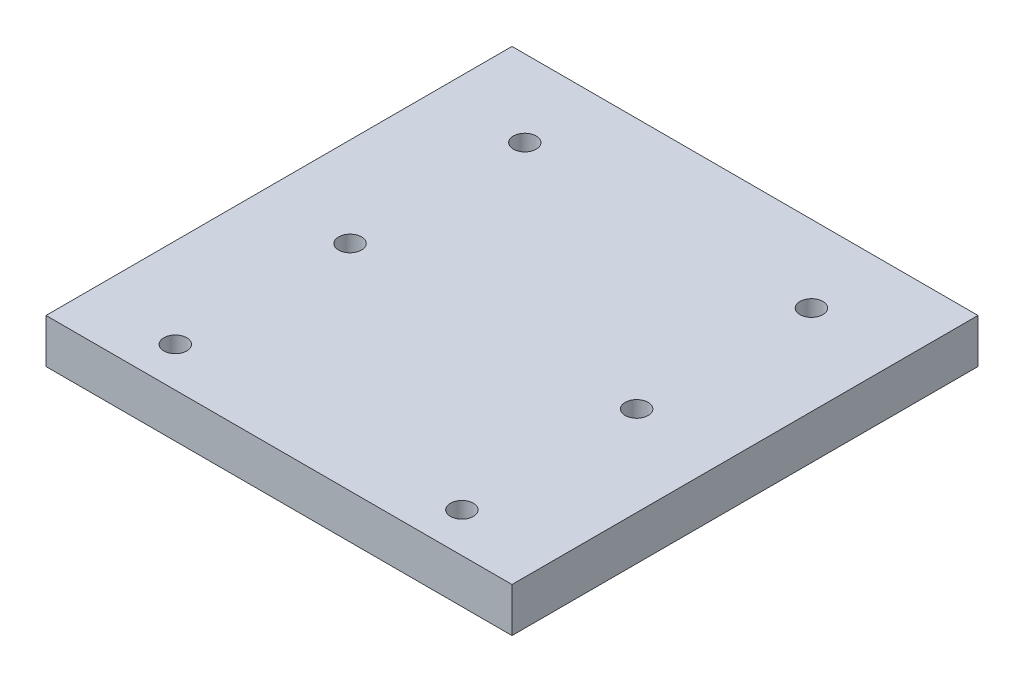
ISO-10303-21;
HEADER;
FILE_DESCRIPTION(('STEP AP214'),'2;1');
FILE_NAME('part.step','',(''),(''),'','','');
FILE_SCHEMA(('AUTOMOTIVE_DESIGN { 1 0 10303 214 1 1 1 1 }'));
ENDSEC;
DATA;
#1=APPLICATION_CONTEXT('core data for automotive mechanical design processes');
#2=APPLICATION_PROTOCOL_DEFINITION('international standard','automotive_design',2000,#1);
#3=PRODUCT_CONTEXT('',#1,'mechanical');
#4=PRODUCT('Part','Part','',(#3));
#5=PRODUCT_RELATED_PRODUCT_CATEGORY('part','',(#4));
#6=PRODUCT_DEFINITION_FORMATION('','',#4);
#7=PRODUCT_DEFINITION_CONTEXT('part definition',#1,'design');
#8=PRODUCT_DEFINITION('design','',#6,#7);
#9=PRODUCT_DEFINITION_SHAPE('','',#8);
#10=(LENGTH_UNIT() NAMED_UNIT(*) SI_UNIT(.MILLI.,.METRE.));
#11=(NAMED_UNIT(*) PLANE_ANGLE_UNIT() SI_UNIT($,.RADIAN.));
#12=(NAMED_UNIT(*) SI_UNIT($,.STERADIAN.) SOLID_ANGLE_UNIT());
#13=UNCERTAINTY_MEASURE_WITH_UNIT(LENGTH_MEASURE(1.E-05),#10,'distance_accuracy_value','');
#14=(GEOMETRIC_REPRESENTATION_CONTEXT(3) GLOBAL_UNCERTAINTY_ASSIGNED_CONTEXT((#13)) GLOBAL_UNIT_ASSIGNED_CONTEXT((#10,
#11,#12)) REPRESENTATION_CONTEXT('',''));
#15=CARTESIAN_POINT('',(0.,0.,0.));
#16=DIRECTION('',(0.,0.,1.));
#17=DIRECTION('',(1.,0.,0.));
#18=AXIS2_PLACEMENT_3D('',#15,#16,#17);
#19=CARTESIAN_POINT('',(25.4,-4.826,-25.4));
#20=DIRECTION('',(1.,0.,0.));
#21=DIRECTION('',(0.,0.,-1.));
#22=AXIS2_PLACEMENT_3D('',#19,#20,#21);
#23=PLANE('',#22);
#24=DIRECTION('',(0.,0.,-1.));
#25=VECTOR('',#24,1.);
#26=CARTESIAN_POINT('',(25.4,0.,-25.4));
#27=LINE('',#26,#25);
#28=CARTESIAN_POINT('',(25.4,0.,25.4));
#29=VERTEX_POINT('',#28);
#30=CARTESIAN_POINT('',(25.4,0.,-25.4));
#31=VERTEX_POINT('',#30);
#32=EDGE_CURVE('E105',#29,#31,#27,.T.);
#33=ORIENTED_EDGE('',*,*,#32,.F.);
#34=DIRECTION('',(0.,1.,0.));
#35=VECTOR('',#34,1.);
#36=CARTESIAN_POINT('',(25.4,-4.826,25.4));
#37=LINE('',#36,#35);
#38=CARTESIAN_POINT('',(25.4,-4.826,25.4));
#39=VERTEX_POINT('',#38);
#40=EDGE_CURVE('E52',#39,#29,#37,.T.);
#41=ORIENTED_EDGE('',*,*,#40,.F.);
#42=DIRECTION('',(0.,0.,-1.));
#43=VECTOR('',#42,1.);
#44=CARTESIAN_POINT('',(25.4,-4.826,-25.4));
#45=LINE('',#44,#43);
#46=CARTESIAN_POINT('',(25.4,-4.826,-25.4));
#47=VERTEX_POINT('',#46);
#48=EDGE_CURVE('E98',#39,#47,#45,.T.);
#49=ORIENTED_EDGE('',*,*,#48,.T.);
#50=DIRECTION('',(0.,1.,0.));
#51=VECTOR('',#50,1.);
#52=CARTESIAN_POINT('',(25.4,-4.826,-25.4));
#53=LINE('',#52,#51);
#54=EDGE_CURVE('E80',#47,#31,#53,.T.);
#55=ORIENTED_EDGE('',*,*,#54,.T.);
#56=EDGE_LOOP('',(#33,#41,#49,#55));
#57=FACE_BOUND('',#56,.T.);
#58=ADVANCED_FACE('F35',(#57),#23,.T.);
#59=CARTESIAN_POINT('',(-25.4,-4.826,25.4));
#60=DIRECTION('',(0.,0.,1.));
#61=DIRECTION('',(1.,0.,0.));
#62=AXIS2_PLACEMENT_3D('',#59,#60,#61);
#63=PLANE('',#62);
#64=DIRECTION('',(1.,0.,0.));
#65=VECTOR('',#64,1.);
#66=CARTESIAN_POINT('',(-25.4,0.,25.4));
#67=LINE('',#66,#65);
#68=CARTESIAN_POINT('',(-25.4,0.,25.4));
#69=VERTEX_POINT('',#68);
#70=EDGE_CURVE('E100',#69,#29,#67,.T.);
#71=ORIENTED_EDGE('',*,*,#70,.F.);
#72=DIRECTION('',(0.,1.,0.));
#73=VECTOR('',#72,1.);
#74=CARTESIAN_POINT('',(-25.4,-4.826,25.4));
#75=LINE('',#74,#73);
#76=CARTESIAN_POINT('',(-25.4,-4.826,25.4));
#77=VERTEX_POINT('',#76);
#78=EDGE_CURVE('E69',#77,#69,#75,.T.);
#79=ORIENTED_EDGE('',*,*,#78,.F.);
#80=DIRECTION('',(1.,0.,0.));
#81=VECTOR('',#80,1.);
#82=CARTESIAN_POINT('',(-25.4,-4.826,25.4));
#83=LINE('',#82,#81);
#84=EDGE_CURVE('E95',#77,#39,#83,.T.);
#85=ORIENTED_EDGE('',*,*,#84,.T.);
#86=ORIENTED_EDGE('',*,*,#40,.T.);
#87=EDGE_LOOP('',(#71,#79,#85,#86));
#88=FACE_BOUND('',#87,.T.);
#89=ADVANCED_FACE('F145',(#88),#63,.T.);
#90=CARTESIAN_POINT('',(-25.4,-4.826,-25.4));
#91=DIRECTION('',(-1.,0.,0.));
#92=DIRECTION('',(0.,0.,1.));
#93=AXIS2_PLACEMENT_3D('',#90,#91,#92);
#94=PLANE('',#93);
#95=DIRECTION('',(0.,0.,1.));
#96=VECTOR('',#95,1.);
#97=CARTESIAN_POINT('',(-25.4,0.,-25.4));
#98=LINE('',#97,#96);
#99=CARTESIAN_POINT('',(-25.4,0.,-25.4));
#100=VERTEX_POINT('',#99);
#101=EDGE_CURVE('E88',#100,#69,#98,.T.);
#102=ORIENTED_EDGE('',*,*,#101,.F.);
#103=DIRECTION('',(0.,1.,0.));
#104=VECTOR('',#103,1.);
#105=CARTESIAN_POINT('',(-25.4,-4.826,-25.4));
#106=LINE('',#105,#104);
#107=CARTESIAN_POINT('',(-25.4,-4.826,-25.4));
#108=VERTEX_POINT('',#107);
#109=EDGE_CURVE('E83',#108,#100,#106,.T.);
#110=ORIENTED_EDGE('',*,*,#109,.F.);
#111=DIRECTION('',(0.,0.,1.));
#112=VECTOR('',#111,1.);
#113=CARTESIAN_POINT('',(-25.4,-4.826,-25.4));
#114=LINE('',#113,#112);
#115=EDGE_CURVE('E86',#108,#77,#114,.T.);
#116=ORIENTED_EDGE('',*,*,#115,.T.);
#117=ORIENTED_EDGE('',*,*,#78,.T.);
#118=EDGE_LOOP('',(#102,#110,#116,#117));
#119=FACE_BOUND('',#118,.T.);
#120=ADVANCED_FACE('F85',(#119),#94,.T.);
#121=CARTESIAN_POINT('',(-25.4,-4.826,-25.4));
#122=DIRECTION('',(0.,0.,-1.));
#123=DIRECTION('',(-1.,0.,0.));
#124=AXIS2_PLACEMENT_3D('',#121,#122,#123);
#125=PLANE('',#124);
#126=DIRECTION('',(-1.,0.,0.));
#127=VECTOR('',#126,1.);
#128=CARTESIAN_POINT('',(-25.4,0.,-25.4));
#129=LINE('',#128,#127);
#130=EDGE_CURVE('E108',#31,#100,#129,.T.);
#131=ORIENTED_EDGE('',*,*,#130,.F.);
#132=ORIENTED_EDGE('',*,*,#54,.F.);
#133=DIRECTION('',(-1.,0.,0.));
#134=VECTOR('',#133,1.);
#135=CARTESIAN_POINT('',(-25.4,-4.826,-25.4));
#136=LINE('',#135,#134);
#137=EDGE_CURVE('E94',#47,#108,#136,.T.);
#138=ORIENTED_EDGE('',*,*,#137,.T.);
#139=ORIENTED_EDGE('',*,*,#109,.T.);
#140=EDGE_LOOP('',(#131,#132,#138,#139));
#141=FACE_BOUND('',#140,.T.);
#142=ADVANCED_FACE('F97',(#141),#125,.T.);
#143=CARTESIAN_POINT('',(0.,-4.826,0.));
#144=DIRECTION('',(0.,1.,0.));
#145=DIRECTION('',(0.,0.,1.));
#146=AXIS2_PLACEMENT_3D('',#143,#144,#145);
#147=PLANE('',#146);
#148=CARTESIAN_POINT('',(-15.621,-4.826,2.032));
#149=DIRECTION('',(0.,1.,0.));
#150=DIRECTION('',(0.,0.,1.));
#151=AXIS2_PLACEMENT_3D('',#148,#149,#150);
#152=CIRCLE('',#151,1.25);
#153=CARTESIAN_POINT('',(-15.621,-4.826,3.282));
#154=VERTEX_POINT('',#153);
#155=EDGE_CURVE('E264',#154,#154,#152,.T.);
#156=ORIENTED_EDGE('',*,*,#155,.T.);
#157=EDGE_LOOP('',(#156));
#158=FACE_BOUND('',#157,.T.);
#159=CARTESIAN_POINT('',(15.621,-4.826,2.032));
#160=DIRECTION('',(0.,1.,0.));
#161=DIRECTION('',(0.,0.,1.));
#162=AXIS2_PLACEMENT_3D('',#159,#160,#161);
#163=CIRCLE('',#162,1.25);
#164=CARTESIAN_POINT('',(15.621,-4.826,3.282));
#165=VERTEX_POINT('',#164);
#166=EDGE_CURVE('E252',#165,#165,#163,.T.);
#167=ORIENTED_EDGE('',*,*,#166,.T.);
#168=EDGE_LOOP('',(#167));
#169=FACE_BOUND('',#168,.T.);
#170=CARTESIAN_POINT('',(15.621,-4.826,-17.018));
#171=DIRECTION('',(0.,1.,0.));
#172=DIRECTION('',(0.,0.,1.));
#173=AXIS2_PLACEMENT_3D('',#170,#171,#172);
#174=CIRCLE('',#173,1.25);
#175=CARTESIAN_POINT('',(15.621,-4.826,-15.768));
#176=VERTEX_POINT('',#175);
#177=EDGE_CURVE('E246',#176,#176,#174,.T.);
#178=ORIENTED_EDGE('',*,*,#177,.T.);
#179=EDGE_LOOP('',(#178));
#180=FACE_BOUND('',#179,.T.);
#181=CARTESIAN_POINT('',(-15.621,-4.826,-17.018));
#182=DIRECTION('',(0.,1.,0.));
#183=DIRECTION('',(0.,0.,1.));
#184=AXIS2_PLACEMENT_3D('',#181,#182,#183);
#185=CIRCLE('',#184,1.25);
#186=CARTESIAN_POINT('',(-15.621,-4.826,-15.768));
#187=VERTEX_POINT('',#186);
#188=EDGE_CURVE('E109',#187,#187,#185,.T.);
#189=ORIENTED_EDGE('',*,*,#188,.T.);
#190=EDGE_LOOP('',(#189));
#191=FACE_BOUND('',#190,.T.);
#192=ORIENTED_EDGE('',*,*,#48,.F.);
#193=ORIENTED_EDGE('',*,*,#84,.F.);
#194=ORIENTED_EDGE('',*,*,#115,.F.);
#195=ORIENTED_EDGE('',*,*,#137,.F.);
#196=EDGE_LOOP('',(#192,#193,#194,#195));
#197=FACE_BOUND('',#196,.T.);
#198=CARTESIAN_POINT('',(15.621,-4.826,21.082));
#199=DIRECTION('',(0.,1.,0.));
#200=DIRECTION('',(0.,0.,1.));
#201=AXIS2_PLACEMENT_3D('',#198,#199,#200);
#202=CIRCLE('',#201,1.25);
#203=CARTESIAN_POINT('',(15.621,-4.826,22.332));
#204=VERTEX_POINT('',#203);
#205=EDGE_CURVE('E120',#204,#204,#202,.T.);
#206=ORIENTED_EDGE('',*,*,#205,.T.);
#207=EDGE_LOOP('',(#206));
#208=FACE_BOUND('',#207,.T.);
#209=CARTESIAN_POINT('',(-15.621,-4.826,21.082));
#210=DIRECTION('',(0.,1.,0.));
#211=DIRECTION('',(0.,0.,1.));
#212=AXIS2_PLACEMENT_3D('',#209,#210,#211);
#213=CIRCLE('',#212,1.25);
#214=CARTESIAN_POINT('',(-15.621,-4.826,22.332));
#215=VERTEX_POINT('',#214);
#216=EDGE_CURVE('E11',#215,#215,#213,.T.);
#217=ORIENTED_EDGE('',*,*,#216,.T.);
#218=EDGE_LOOP('',(#217));
#219=FACE_BOUND('',#218,.T.);
#220=ADVANCED_FACE('F92',(#158,#169,#180,#191,#197,#208,#219),#147,.F.);
#221=CARTESIAN_POINT('',(0.,0.,0.));
#222=DIRECTION('',(0.,1.,0.));
#223=DIRECTION('',(0.,0.,1.));
#224=AXIS2_PLACEMENT_3D('',#221,#222,#223);
#225=PLANE('',#224);
#226=CARTESIAN_POINT('',(-15.621,0.,2.032));
#227=DIRECTION('',(0.,1.,0.));
#228=DIRECTION('',(0.,0.,1.));
#229=AXIS2_PLACEMENT_3D('',#226,#227,#228);
#230=CIRCLE('',#229,1.25);
#231=CARTESIAN_POINT('',(-15.621,0.,3.282));
#232=VERTEX_POINT('',#231);
#233=EDGE_CURVE('E267',#232,#232,#230,.T.);
#234=ORIENTED_EDGE('',*,*,#233,.F.);
#235=EDGE_LOOP('',(#234));
#236=FACE_BOUND('',#235,.T.);
#237=CARTESIAN_POINT('',(15.621,0.,2.032));
#238=DIRECTION('',(0.,1.,0.));
#239=DIRECTION('',(0.,0.,1.));
#240=AXIS2_PLACEMENT_3D('',#237,#238,#239);
#241=CIRCLE('',#240,1.25);
#242=CARTESIAN_POINT('',(15.621,0.,3.282));
#243=VERTEX_POINT('',#242);
#244=EDGE_CURVE('E261',#243,#243,#241,.T.);
#245=ORIENTED_EDGE('',*,*,#244,.F.);
#246=EDGE_LOOP('',(#245));
#247=FACE_BOUND('',#246,.T.);
#248=CARTESIAN_POINT('',(15.621,0.,-17.018));
#249=DIRECTION('',(0.,1.,0.));
#250=DIRECTION('',(0.,0.,1.));
#251=AXIS2_PLACEMENT_3D('',#248,#249,#250);
#252=CIRCLE('',#251,1.25);
#253=CARTESIAN_POINT('',(15.621,0.,-15.768));
#254=VERTEX_POINT('',#253);
#255=EDGE_CURVE('E243',#254,#254,#252,.T.);
#256=ORIENTED_EDGE('',*,*,#255,.F.);
#257=EDGE_LOOP('',(#256));
#258=FACE_BOUND('',#257,.T.);
#259=CARTESIAN_POINT('',(-15.621,0.,-17.018));
#260=DIRECTION('',(0.,1.,0.));
#261=DIRECTION('',(0.,0.,1.));
#262=AXIS2_PLACEMENT_3D('',#259,#260,#261);
#263=CIRCLE('',#262,1.25);
#264=CARTESIAN_POINT('',(-15.621,0.,-15.768));
#265=VERTEX_POINT('',#264);
#266=EDGE_CURVE('E248',#265,#265,#263,.T.);
#267=ORIENTED_EDGE('',*,*,#266,.F.);
#268=EDGE_LOOP('',(#267));
#269=FACE_BOUND('',#268,.T.);
#270=ORIENTED_EDGE('',*,*,#32,.T.);
#271=ORIENTED_EDGE('',*,*,#130,.T.);
#272=ORIENTED_EDGE('',*,*,#101,.T.);
#273=ORIENTED_EDGE('',*,*,#70,.T.);
#274=EDGE_LOOP('',(#270,#271,#272,#273));
#275=FACE_BOUND('',#274,.T.);
#276=CARTESIAN_POINT('',(15.621,0.,21.082));
#277=DIRECTION('',(0.,1.,0.));
#278=DIRECTION('',(0.,0.,1.));
#279=AXIS2_PLACEMENT_3D('',#276,#277,#278);
#280=CIRCLE('',#279,1.25);
#281=CARTESIAN_POINT('',(15.621,0.,22.332));
#282=VERTEX_POINT('',#281);
#283=EDGE_CURVE('E115',#282,#282,#280,.T.);
#284=ORIENTED_EDGE('',*,*,#283,.F.);
#285=EDGE_LOOP('',(#284));
#286=FACE_BOUND('',#285,.T.);
#287=CARTESIAN_POINT('',(-15.621,0.,21.082));
#288=DIRECTION('',(0.,1.,0.));
#289=DIRECTION('',(0.,0.,1.));
#290=AXIS2_PLACEMENT_3D('',#287,#288,#289);
#291=CIRCLE('',#290,1.25);
#292=CARTESIAN_POINT('',(-15.621,0.,22.332));
#293=VERTEX_POINT('',#292);
#294=EDGE_CURVE('E44',#293,#293,#291,.T.);
#295=ORIENTED_EDGE('',*,*,#294,.F.);
#296=EDGE_LOOP('',(#295));
#297=FACE_BOUND('',#296,.T.);
#298=ADVANCED_FACE('F127',(#236,#247,#258,#269,#275,#286,#297),#225,.T.);
#299=CARTESIAN_POINT('',(-15.621,-9.906,-17.018));
#300=DIRECTION('',(0.,1.,0.));
#301=DIRECTION('',(0.,0.,1.));
#302=AXIS2_PLACEMENT_3D('',#299,#300,#301);
#303=CYLINDRICAL_SURFACE('',#302,1.25);
#304=ORIENTED_EDGE('',*,*,#266,.T.);
#305=EDGE_LOOP('',(#304));
#306=FACE_BOUND('',#305,.T.);
#307=ORIENTED_EDGE('',*,*,#188,.F.);
#308=EDGE_LOOP('',(#307));
#309=FACE_BOUND('',#308,.T.);
#310=ADVANCED_FACE('F129',(#306,#309),#303,.F.);
#311=CARTESIAN_POINT('',(15.621,-9.906,-17.018));
#312=DIRECTION('',(0.,1.,0.));
#313=DIRECTION('',(0.,0.,1.));
#314=AXIS2_PLACEMENT_3D('',#311,#312,#313);
#315=CYLINDRICAL_SURFACE('',#314,1.25);
#316=ORIENTED_EDGE('',*,*,#255,.T.);
#317=EDGE_LOOP('',(#316));
#318=FACE_BOUND('',#317,.T.);
#319=ORIENTED_EDGE('',*,*,#177,.F.);
#320=EDGE_LOOP('',(#319));
#321=FACE_BOUND('',#320,.T.);
#322=ADVANCED_FACE('F136',(#318,#321),#315,.F.);
#323=CARTESIAN_POINT('',(15.621,-9.906,2.032));
#324=DIRECTION('',(0.,1.,0.));
#325=DIRECTION('',(0.,0.,1.));
#326=AXIS2_PLACEMENT_3D('',#323,#324,#325);
#327=CYLINDRICAL_SURFACE('',#326,1.25);
#328=ORIENTED_EDGE('',*,*,#244,.T.);
#329=EDGE_LOOP('',(#328));
#330=FACE_BOUND('',#329,.T.);
#331=ORIENTED_EDGE('',*,*,#166,.F.);
#332=EDGE_LOOP('',(#331));
#333=FACE_BOUND('',#332,.T.);
#334=ADVANCED_FACE('F155',(#330,#333),#327,.F.);
#335=CARTESIAN_POINT('',(15.621,-9.906,21.082));
#336=DIRECTION('',(0.,1.,0.));
#337=DIRECTION('',(0.,0.,1.));
#338=AXIS2_PLACEMENT_3D('',#335,#336,#337);
#339=CYLINDRICAL_SURFACE('',#338,1.25);
#340=ORIENTED_EDGE('',*,*,#283,.T.);
#341=EDGE_LOOP('',(#340));
#342=FACE_BOUND('',#341,.T.);
#343=ORIENTED_EDGE('',*,*,#205,.F.);
#344=EDGE_LOOP('',(#343));
#345=FACE_BOUND('',#344,.T.);
#346=ADVANCED_FACE('F152',(#342,#345),#339,.F.);
#347=CARTESIAN_POINT('',(-15.621,-9.906,2.032));
#348=DIRECTION('',(0.,1.,0.));
#349=DIRECTION('',(0.,0.,1.));
#350=AXIS2_PLACEMENT_3D('',#347,#348,#349);
#351=CYLINDRICAL_SURFACE('',#350,1.25);
#352=ORIENTED_EDGE('',*,*,#233,.T.);
#353=EDGE_LOOP('',(#352));
#354=FACE_BOUND('',#353,.T.);
#355=ORIENTED_EDGE('',*,*,#155,.F.);
#356=EDGE_LOOP('',(#355));
#357=FACE_BOUND('',#356,.T.);
#358=ADVANCED_FACE('F154',(#354,#357),#351,.F.);
#359=CARTESIAN_POINT('',(-15.621,-9.906,21.082));
#360=DIRECTION('',(0.,1.,0.));
#361=DIRECTION('',(0.,0.,1.));
#362=AXIS2_PLACEMENT_3D('',#359,#360,#361);
#363=CYLINDRICAL_SURFACE('',#362,1.25);
#364=ORIENTED_EDGE('',*,*,#294,.T.);
#365=EDGE_LOOP('',(#364));
#366=FACE_BOUND('',#365,.T.);
#367=ORIENTED_EDGE('',*,*,#216,.F.);
#368=EDGE_LOOP('',(#367));
#369=FACE_BOUND('',#368,.T.);
#370=ADVANCED_FACE('F37',(#366,#369),#363,.F.);
#371=CLOSED_SHELL('',(#58,#89,#120,#142,#220,#298,#310,#322,#334,#346,#358,#370));
#372=MANIFOLD_SOLID_BREP('B2',#371);
#373=ADVANCED_BREP_SHAPE_REPRESENTATION('',(#18,#372),#14);
#374=SHAPE_DEFINITION_REPRESENTATION(#9,#373);
ENDSEC;
END-ISO-10303-21;
